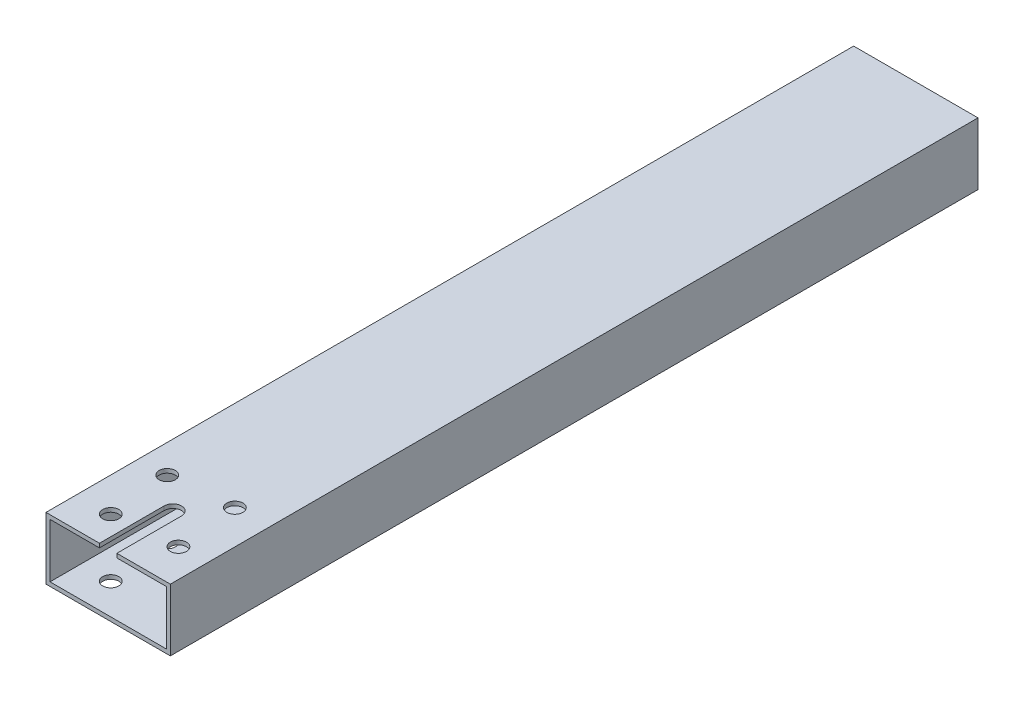
ISO-10303-21;
HEADER;
FILE_DESCRIPTION(('STEP AP214'),'2;1');
FILE_NAME('part.step','',(''),(''),'','','');
FILE_SCHEMA(('AUTOMOTIVE_DESIGN { 1 0 10303 214 1 1 1 1 }'));
ENDSEC;
DATA;
#1=APPLICATION_CONTEXT('core data for automotive mechanical design processes');
#2=APPLICATION_PROTOCOL_DEFINITION('international standard','automotive_design',2000,#1);
#3=PRODUCT_CONTEXT('',#1,'mechanical');
#4=PRODUCT('Part','Part','',(#3));
#5=PRODUCT_RELATED_PRODUCT_CATEGORY('part','',(#4));
#6=PRODUCT_DEFINITION_FORMATION('','',#4);
#7=PRODUCT_DEFINITION_CONTEXT('part definition',#1,'design');
#8=PRODUCT_DEFINITION('design','',#6,#7);
#9=PRODUCT_DEFINITION_SHAPE('','',#8);
#10=(LENGTH_UNIT() NAMED_UNIT(*) SI_UNIT(.MILLI.,.METRE.));
#11=(NAMED_UNIT(*) PLANE_ANGLE_UNIT() SI_UNIT($,.RADIAN.));
#12=(NAMED_UNIT(*) SI_UNIT($,.STERADIAN.) SOLID_ANGLE_UNIT());
#13=UNCERTAINTY_MEASURE_WITH_UNIT(LENGTH_MEASURE(1.E-05),#10,'distance_accuracy_value','');
#14=(GEOMETRIC_REPRESENTATION_CONTEXT(3) GLOBAL_UNCERTAINTY_ASSIGNED_CONTEXT((#13)) GLOBAL_UNIT_ASSIGNED_CONTEXT((#10,
#11,#12)) REPRESENTATION_CONTEXT('',''));
#15=CARTESIAN_POINT('',(0.,0.,0.));
#16=DIRECTION('',(0.,0.,1.));
#17=DIRECTION('',(1.,0.,0.));
#18=AXIS2_PLACEMENT_3D('',#15,#16,#17);
#19=CARTESIAN_POINT('',(0.,0.,330.));
#20=DIRECTION('',(0.,0.,1.));
#21=DIRECTION('',(1.,0.,0.));
#22=AXIS2_PLACEMENT_3D('',#19,#20,#21);
#23=PLANE('',#22);
#24=DIRECTION('',(0.,1.,0.));
#25=VECTOR('',#24,1.);
#26=CARTESIAN_POINT('',(7.83839252336444,8.67635514018689,330.));
#27=LINE('',#26,#25);
#28=CARTESIAN_POINT('',(7.83839252336444,15.9153551401869,330.));
#29=VERTEX_POINT('',#28);
#30=CARTESIAN_POINT('',(7.83839252336444,17.5663551401869,330.));
#31=VERTEX_POINT('',#30);
#32=EDGE_CURVE('E156',#29,#31,#27,.T.);
#33=ORIENTED_EDGE('',*,*,#32,.T.);
#34=DIRECTION('',(-1.,0.,0.));
#35=VECTOR('',#34,1.);
#36=CARTESIAN_POINT('',(-14.0056074766356,17.5663551401869,330.));
#37=LINE('',#36,#35);
#38=CARTESIAN_POINT('',(-14.0056074766356,17.5663551401869,330.));
#39=VERTEX_POINT('',#38);
#40=EDGE_CURVE('E171',#31,#39,#37,.T.);
#41=ORIENTED_EDGE('',*,*,#40,.T.);
#42=DIRECTION('',(0.,-1.,0.));
#43=VECTOR('',#42,1.);
#44=CARTESIAN_POINT('',(-14.0056074766356,17.5663551401869,330.));
#45=LINE('',#44,#43);
#46=CARTESIAN_POINT('',(-14.0056074766356,-7.83364485981309,330.));
#47=VERTEX_POINT('',#46);
#48=EDGE_CURVE('E250',#39,#47,#45,.T.);
#49=ORIENTED_EDGE('',*,*,#48,.T.);
#50=DIRECTION('',(1.,0.,0.));
#51=VECTOR('',#50,1.);
#52=CARTESIAN_POINT('',(-14.0056074766356,-7.83364485981309,330.));
#53=LINE('',#52,#51);
#54=CARTESIAN_POINT('',(36.7943925233644,-7.83364485981309,330.));
#55=VERTEX_POINT('',#54);
#56=EDGE_CURVE('E253',#47,#55,#53,.T.);
#57=ORIENTED_EDGE('',*,*,#56,.T.);
#58=DIRECTION('',(0.,1.,0.));
#59=VECTOR('',#58,1.);
#60=CARTESIAN_POINT('',(36.7943925233644,17.5663551401869,330.));
#61=LINE('',#60,#59);
#62=CARTESIAN_POINT('',(36.7943925233644,17.5663551401869,330.));
#63=VERTEX_POINT('',#62);
#64=EDGE_CURVE('E256',#55,#63,#61,.T.);
#65=ORIENTED_EDGE('',*,*,#64,.T.);
#66=CARTESIAN_POINT('',(14.9503925233644,17.5663551401869,330.));
#67=VERTEX_POINT('',#66);
#68=EDGE_CURVE('E258',#63,#67,#37,.T.);
#69=ORIENTED_EDGE('',*,*,#68,.T.);
#70=DIRECTION('',(0.,1.,0.));
#71=VECTOR('',#70,1.);
#72=CARTESIAN_POINT('',(14.9503925233644,8.67635514018689,330.));
#73=LINE('',#72,#71);
#74=CARTESIAN_POINT('',(14.9503925233644,15.9153551401869,330.));
#75=VERTEX_POINT('',#74);
#76=EDGE_CURVE('E177',#75,#67,#73,.T.);
#77=ORIENTED_EDGE('',*,*,#76,.F.);
#78=DIRECTION('',(-1.,0.,0.));
#79=VECTOR('',#78,1.);
#80=CARTESIAN_POINT('',(-12.3546074766356,15.9153551401869,330.));
#81=LINE('',#80,#79);
#82=CARTESIAN_POINT('',(35.1433925233644,15.9153551401869,330.));
#83=VERTEX_POINT('',#82);
#84=EDGE_CURVE('E228',#83,#75,#81,.T.);
#85=ORIENTED_EDGE('',*,*,#84,.F.);
#86=DIRECTION('',(0.,1.,0.));
#87=VECTOR('',#86,1.);
#88=CARTESIAN_POINT('',(35.1433925233644,15.9153551401869,330.));
#89=LINE('',#88,#87);
#90=CARTESIAN_POINT('',(35.1433925233644,-6.18264485981309,330.));
#91=VERTEX_POINT('',#90);
#92=EDGE_CURVE('E225',#91,#83,#89,.T.);
#93=ORIENTED_EDGE('',*,*,#92,.F.);
#94=DIRECTION('',(1.,0.,0.));
#95=VECTOR('',#94,1.);
#96=CARTESIAN_POINT('',(-12.3546074766356,-6.18264485981309,330.));
#97=LINE('',#96,#95);
#98=CARTESIAN_POINT('',(-12.3546074766356,-6.18264485981309,330.));
#99=VERTEX_POINT('',#98);
#100=EDGE_CURVE('E222',#99,#91,#97,.T.);
#101=ORIENTED_EDGE('',*,*,#100,.F.);
#102=DIRECTION('',(0.,-1.,0.));
#103=VECTOR('',#102,1.);
#104=CARTESIAN_POINT('',(-12.3546074766356,15.9153551401869,330.));
#105=LINE('',#104,#103);
#106=CARTESIAN_POINT('',(-12.3546074766356,15.9153551401869,330.));
#107=VERTEX_POINT('',#106);
#108=EDGE_CURVE('E220',#107,#99,#105,.T.);
#109=ORIENTED_EDGE('',*,*,#108,.F.);
#110=EDGE_CURVE('E227',#29,#107,#81,.T.);
#111=ORIENTED_EDGE('',*,*,#110,.F.);
#112=EDGE_LOOP('',(#33,#41,#49,#57,#65,#69,#77,#85,#93,#101,#109,#111));
#113=FACE_BOUND('',#112,.T.);
#114=ADVANCED_FACE('F63',(#113),#23,.T.);
#115=CARTESIAN_POINT('',(0.,0.,0.));
#116=DIRECTION('',(0.,0.,1.));
#117=DIRECTION('',(1.,0.,0.));
#118=AXIS2_PLACEMENT_3D('',#115,#116,#117);
#119=PLANE('',#118);
#120=DIRECTION('',(0.,-1.,0.));
#121=VECTOR('',#120,1.);
#122=CARTESIAN_POINT('',(-14.0056074766356,17.5663551401869,0.));
#123=LINE('',#122,#121);
#124=CARTESIAN_POINT('',(-14.0056074766356,17.5663551401869,0.));
#125=VERTEX_POINT('',#124);
#126=CARTESIAN_POINT('',(-14.0056074766356,-7.83364485981309,0.));
#127=VERTEX_POINT('',#126);
#128=EDGE_CURVE('E249',#125,#127,#123,.T.);
#129=ORIENTED_EDGE('',*,*,#128,.F.);
#130=DIRECTION('',(-1.,0.,0.));
#131=VECTOR('',#130,1.);
#132=CARTESIAN_POINT('',(-14.0056074766356,17.5663551401869,0.));
#133=LINE('',#132,#131);
#134=CARTESIAN_POINT('',(36.7943925233644,17.5663551401869,0.));
#135=VERTEX_POINT('',#134);
#136=EDGE_CURVE('E254',#135,#125,#133,.T.);
#137=ORIENTED_EDGE('',*,*,#136,.F.);
#138=DIRECTION('',(0.,1.,0.));
#139=VECTOR('',#138,1.);
#140=CARTESIAN_POINT('',(36.7943925233644,17.5663551401869,0.));
#141=LINE('',#140,#139);
#142=CARTESIAN_POINT('',(36.7943925233644,-7.83364485981309,0.));
#143=VERTEX_POINT('',#142);
#144=EDGE_CURVE('E266',#143,#135,#141,.T.);
#145=ORIENTED_EDGE('',*,*,#144,.F.);
#146=DIRECTION('',(1.,0.,0.));
#147=VECTOR('',#146,1.);
#148=CARTESIAN_POINT('',(-14.0056074766356,-7.83364485981309,0.));
#149=LINE('',#148,#147);
#150=EDGE_CURVE('E264',#127,#143,#149,.T.);
#151=ORIENTED_EDGE('',*,*,#150,.F.);
#152=EDGE_LOOP('',(#129,#137,#145,#151));
#153=FACE_BOUND('',#152,.T.);
#154=DIRECTION('',(0.,-1.,0.));
#155=VECTOR('',#154,1.);
#156=CARTESIAN_POINT('',(-12.3546074766356,15.9153551401869,0.));
#157=LINE('',#156,#155);
#158=CARTESIAN_POINT('',(-12.3546074766356,15.9153551401869,0.));
#159=VERTEX_POINT('',#158);
#160=CARTESIAN_POINT('',(-12.3546074766356,-6.18264485981309,0.));
#161=VERTEX_POINT('',#160);
#162=EDGE_CURVE('E219',#159,#161,#157,.T.);
#163=ORIENTED_EDGE('',*,*,#162,.T.);
#164=DIRECTION('',(1.,0.,0.));
#165=VECTOR('',#164,1.);
#166=CARTESIAN_POINT('',(-12.3546074766356,-6.18264485981309,0.));
#167=LINE('',#166,#165);
#168=CARTESIAN_POINT('',(35.1433925233644,-6.18264485981309,0.));
#169=VERTEX_POINT('',#168);
#170=EDGE_CURVE('E233',#161,#169,#167,.T.);
#171=ORIENTED_EDGE('',*,*,#170,.T.);
#172=DIRECTION('',(0.,1.,0.));
#173=VECTOR('',#172,1.);
#174=CARTESIAN_POINT('',(35.1433925233644,15.9153551401869,0.));
#175=LINE('',#174,#173);
#176=CARTESIAN_POINT('',(35.1433925233644,15.9153551401869,0.));
#177=VERTEX_POINT('',#176);
#178=EDGE_CURVE('E236',#169,#177,#175,.T.);
#179=ORIENTED_EDGE('',*,*,#178,.T.);
#180=DIRECTION('',(-1.,0.,0.));
#181=VECTOR('',#180,1.);
#182=CARTESIAN_POINT('',(-12.3546074766356,15.9153551401869,0.));
#183=LINE('',#182,#181);
#184=EDGE_CURVE('E223',#177,#159,#183,.T.);
#185=ORIENTED_EDGE('',*,*,#184,.T.);
#186=EDGE_LOOP('',(#163,#171,#179,#185));
#187=FACE_BOUND('',#186,.T.);
#188=ADVANCED_FACE('F306',(#153,#187),#119,.F.);
#189=CARTESIAN_POINT('',(-14.0056074766356,17.5663551401869,330.));
#190=DIRECTION('',(1.,0.,0.));
#191=DIRECTION('',(0.,1.,0.));
#192=AXIS2_PLACEMENT_3D('',#189,#190,#191);
#193=PLANE('',#192);
#194=ORIENTED_EDGE('',*,*,#128,.T.);
#195=DIRECTION('',(0.,0.,-1.));
#196=VECTOR('',#195,1.);
#197=CARTESIAN_POINT('',(-14.0056074766356,-7.83364485981309,330.));
#198=LINE('',#197,#196);
#199=EDGE_CURVE('E277',#47,#127,#198,.T.);
#200=ORIENTED_EDGE('',*,*,#199,.F.);
#201=ORIENTED_EDGE('',*,*,#48,.F.);
#202=DIRECTION('',(0.,0.,-1.));
#203=VECTOR('',#202,1.);
#204=CARTESIAN_POINT('',(-14.0056074766356,17.5663551401869,330.));
#205=LINE('',#204,#203);
#206=EDGE_CURVE('E261',#39,#125,#205,.T.);
#207=ORIENTED_EDGE('',*,*,#206,.T.);
#208=EDGE_LOOP('',(#194,#200,#201,#207));
#209=FACE_BOUND('',#208,.T.);
#210=ADVANCED_FACE('F65',(#209),#193,.F.);
#211=CARTESIAN_POINT('',(-14.0056074766356,-7.83364485981309,330.));
#212=DIRECTION('',(0.,1.,0.));
#213=DIRECTION('',(0.,0.,1.));
#214=AXIS2_PLACEMENT_3D('',#211,#212,#213);
#215=PLANE('',#214);
#216=CARTESIAN_POINT('',(-0.141249706883617,-7.83364485981309,317.401704524837));
#217=DIRECTION('',(0.,1.,0.));
#218=DIRECTION('',(0.,0.,1.));
#219=AXIS2_PLACEMENT_3D('',#216,#217,#218);
#220=CIRCLE('',#219,3.30000000399997);
#221=CARTESIAN_POINT('',(-0.141249706883617,-7.83364485981309,320.701704528837));
#222=VERTEX_POINT('',#221);
#223=EDGE_CURVE('E193',#222,#222,#220,.T.);
#224=ORIENTED_EDGE('',*,*,#223,.T.);
#225=EDGE_LOOP('',(#224));
#226=FACE_BOUND('',#225,.T.);
#227=CARTESIAN_POINT('',(25.2120970482021,-7.83364485981309,315.119642230248));
#228=DIRECTION('',(0.,1.,0.));
#229=DIRECTION('',(0.,0.,1.));
#230=AXIS2_PLACEMENT_3D('',#227,#228,#229);
#231=CIRCLE('',#230,3.30000000400001);
#232=CARTESIAN_POINT('',(25.2120970482021,-7.83364485981309,318.419642234248));
#233=VERTEX_POINT('',#232);
#234=EDGE_CURVE('E187',#233,#233,#231,.T.);
#235=ORIENTED_EDGE('',*,*,#234,.T.);
#236=EDGE_LOOP('',(#235));
#237=FACE_BOUND('',#236,.T.);
#238=CARTESIAN_POINT('',(22.9300347536127,-7.83364485981309,289.766295475162));
#239=DIRECTION('',(0.,1.,0.));
#240=DIRECTION('',(0.,0.,1.));
#241=AXIS2_PLACEMENT_3D('',#238,#239,#240);
#242=CIRCLE('',#241,3.30000000400003);
#243=CARTESIAN_POINT('',(22.9300347536127,-7.83364485981309,293.066295479162));
#244=VERTEX_POINT('',#243);
#245=EDGE_CURVE('E180',#244,#244,#242,.T.);
#246=ORIENTED_EDGE('',*,*,#245,.T.);
#247=EDGE_LOOP('',(#246));
#248=FACE_BOUND('',#247,.T.);
#249=CARTESIAN_POINT('',(-2.42331200147296,-7.83364485981309,292.048357769752));
#250=DIRECTION('',(0.,1.,0.));
#251=DIRECTION('',(0.,0.,1.));
#252=AXIS2_PLACEMENT_3D('',#249,#250,#251);
#253=CIRCLE('',#252,3.300000004);
#254=CARTESIAN_POINT('',(-2.42331200147296,-7.83364485981309,295.348357773752));
#255=VERTEX_POINT('',#254);
#256=EDGE_CURVE('E198',#255,#255,#253,.T.);
#257=ORIENTED_EDGE('',*,*,#256,.T.);
#258=EDGE_LOOP('',(#257));
#259=FACE_BOUND('',#258,.T.);
#260=ORIENTED_EDGE('',*,*,#150,.T.);
#261=DIRECTION('',(0.,0.,-1.));
#262=VECTOR('',#261,1.);
#263=CARTESIAN_POINT('',(36.7943925233644,-7.83364485981309,330.));
#264=LINE('',#263,#262);
#265=EDGE_CURVE('E274',#55,#143,#264,.T.);
#266=ORIENTED_EDGE('',*,*,#265,.F.);
#267=ORIENTED_EDGE('',*,*,#56,.F.);
#268=ORIENTED_EDGE('',*,*,#199,.T.);
#269=EDGE_LOOP('',(#260,#266,#267,#268));
#270=FACE_BOUND('',#269,.T.);
#271=ADVANCED_FACE('F330',(#226,#237,#248,#259,#270),#215,.F.);
#272=CARTESIAN_POINT('',(36.7943925233644,17.5663551401869,330.));
#273=DIRECTION('',(-1.,0.,0.));
#274=DIRECTION('',(0.,0.,1.));
#275=AXIS2_PLACEMENT_3D('',#272,#273,#274);
#276=PLANE('',#275);
#277=ORIENTED_EDGE('',*,*,#144,.T.);
#278=DIRECTION('',(0.,0.,-1.));
#279=VECTOR('',#278,1.);
#280=CARTESIAN_POINT('',(36.7943925233644,17.5663551401869,330.));
#281=LINE('',#280,#279);
#282=EDGE_CURVE('E271',#63,#135,#281,.T.);
#283=ORIENTED_EDGE('',*,*,#282,.F.);
#284=ORIENTED_EDGE('',*,*,#64,.F.);
#285=ORIENTED_EDGE('',*,*,#265,.T.);
#286=EDGE_LOOP('',(#277,#283,#284,#285));
#287=FACE_BOUND('',#286,.T.);
#288=ADVANCED_FACE('F337',(#287),#276,.F.);
#289=CARTESIAN_POINT('',(-14.0056074766356,17.5663551401869,330.));
#290=DIRECTION('',(0.,-1.,0.));
#291=DIRECTION('',(0.,0.,-1.));
#292=AXIS2_PLACEMENT_3D('',#289,#290,#291);
#293=PLANE('',#292);
#294=CARTESIAN_POINT('',(-0.141249706883617,17.5663551401869,317.401704524837));
#295=DIRECTION('',(0.,1.,0.));
#296=DIRECTION('',(0.,0.,1.));
#297=AXIS2_PLACEMENT_3D('',#294,#295,#296);
#298=CIRCLE('',#297,3.30000000399997);
#299=CARTESIAN_POINT('',(-0.141249706883617,17.5663551401869,320.701704528837));
#300=VERTEX_POINT('',#299);
#301=EDGE_CURVE('E176',#300,#300,#298,.T.);
#302=ORIENTED_EDGE('',*,*,#301,.F.);
#303=EDGE_LOOP('',(#302));
#304=FACE_BOUND('',#303,.T.);
#305=CARTESIAN_POINT('',(25.2120970482021,17.5663551401869,315.119642230248));
#306=DIRECTION('',(0.,1.,0.));
#307=DIRECTION('',(0.,0.,1.));
#308=AXIS2_PLACEMENT_3D('',#305,#306,#307);
#309=CIRCLE('',#308,3.30000000400001);
#310=CARTESIAN_POINT('',(25.2120970482021,17.5663551401869,318.419642234248));
#311=VERTEX_POINT('',#310);
#312=EDGE_CURVE('E190',#311,#311,#309,.T.);
#313=ORIENTED_EDGE('',*,*,#312,.F.);
#314=EDGE_LOOP('',(#313));
#315=FACE_BOUND('',#314,.T.);
#316=CARTESIAN_POINT('',(22.9300347536127,17.5663551401869,289.766295475162));
#317=DIRECTION('',(0.,1.,0.));
#318=DIRECTION('',(0.,0.,1.));
#319=AXIS2_PLACEMENT_3D('',#316,#317,#318);
#320=CIRCLE('',#319,3.30000000400003);
#321=CARTESIAN_POINT('',(22.9300347536127,17.5663551401869,293.066295479162));
#322=VERTEX_POINT('',#321);
#323=EDGE_CURVE('E184',#322,#322,#320,.T.);
#324=ORIENTED_EDGE('',*,*,#323,.F.);
#325=EDGE_LOOP('',(#324));
#326=FACE_BOUND('',#325,.T.);
#327=CARTESIAN_POINT('',(-2.42331200147296,17.5663551401869,292.048357769752));
#328=DIRECTION('',(0.,1.,0.));
#329=DIRECTION('',(0.,0.,1.));
#330=AXIS2_PLACEMENT_3D('',#327,#328,#329);
#331=CIRCLE('',#330,3.300000004);
#332=CARTESIAN_POINT('',(-2.42331200147296,17.5663551401869,295.348357773752));
#333=VERTEX_POINT('',#332);
#334=EDGE_CURVE('E183',#333,#333,#331,.T.);
#335=ORIENTED_EDGE('',*,*,#334,.F.);
#336=EDGE_LOOP('',(#335));
#337=FACE_BOUND('',#336,.T.);
#338=ORIENTED_EDGE('',*,*,#40,.F.);
#339=DIRECTION('',(0.,0.,1.));
#340=VECTOR('',#339,1.);
#341=CARTESIAN_POINT('',(7.83839252336443,17.5663551401869,0.));
#342=LINE('',#341,#340);
#343=CARTESIAN_POINT('',(7.83839252336444,17.5663551401869,303.584));
#344=VERTEX_POINT('',#343);
#345=EDGE_CURVE('E152',#344,#31,#342,.T.);
#346=ORIENTED_EDGE('',*,*,#345,.F.);
#347=CARTESIAN_POINT('',(11.3943925233644,17.5663551401869,303.584));
#348=DIRECTION('',(0.,1.,0.));
#349=DIRECTION('',(0.,0.,1.));
#350=AXIS2_PLACEMENT_3D('',#347,#348,#349);
#351=CIRCLE('',#350,3.556);
#352=CARTESIAN_POINT('',(14.9503925233644,17.5663551401869,303.584));
#353=VERTEX_POINT('',#352);
#354=EDGE_CURVE('E160',#353,#344,#351,.T.);
#355=ORIENTED_EDGE('',*,*,#354,.F.);
#356=DIRECTION('',(0.,0.,1.));
#357=VECTOR('',#356,1.);
#358=CARTESIAN_POINT('',(14.9503925233644,17.5663551401869,0.));
#359=LINE('',#358,#357);
#360=EDGE_CURVE('E157',#353,#67,#359,.T.);
#361=ORIENTED_EDGE('',*,*,#360,.T.);
#362=ORIENTED_EDGE('',*,*,#68,.F.);
#363=ORIENTED_EDGE('',*,*,#282,.T.);
#364=ORIENTED_EDGE('',*,*,#136,.T.);
#365=ORIENTED_EDGE('',*,*,#206,.F.);
#366=EDGE_LOOP('',(#338,#346,#355,#361,#362,#363,#364,#365));
#367=FACE_BOUND('',#366,.T.);
#368=ADVANCED_FACE('F169',(#304,#315,#326,#337,#367),#293,.F.);
#369=CARTESIAN_POINT('',(-12.3546074766356,15.9153551401869,330.));
#370=DIRECTION('',(1.,0.,0.));
#371=DIRECTION('',(0.,1.,0.));
#372=AXIS2_PLACEMENT_3D('',#369,#370,#371);
#373=PLANE('',#372);
#374=ORIENTED_EDGE('',*,*,#162,.F.);
#375=DIRECTION('',(0.,0.,-1.));
#376=VECTOR('',#375,1.);
#377=CARTESIAN_POINT('',(-12.3546074766356,15.9153551401869,330.));
#378=LINE('',#377,#376);
#379=EDGE_CURVE('E230',#107,#159,#378,.T.);
#380=ORIENTED_EDGE('',*,*,#379,.F.);
#381=ORIENTED_EDGE('',*,*,#108,.T.);
#382=DIRECTION('',(0.,0.,-1.));
#383=VECTOR('',#382,1.);
#384=CARTESIAN_POINT('',(-12.3546074766356,-6.18264485981309,330.));
#385=LINE('',#384,#383);
#386=EDGE_CURVE('E246',#99,#161,#385,.T.);
#387=ORIENTED_EDGE('',*,*,#386,.T.);
#388=EDGE_LOOP('',(#374,#380,#381,#387));
#389=FACE_BOUND('',#388,.T.);
#390=ADVANCED_FACE('F316',(#389),#373,.T.);
#391=CARTESIAN_POINT('',(-12.3546074766356,-6.18264485981309,330.));
#392=DIRECTION('',(0.,1.,0.));
#393=DIRECTION('',(0.,0.,1.));
#394=AXIS2_PLACEMENT_3D('',#391,#392,#393);
#395=PLANE('',#394);
#396=CARTESIAN_POINT('',(-0.141249706883617,-6.18264485981309,317.401704524837));
#397=DIRECTION('',(0.,1.,0.));
#398=DIRECTION('',(0.,0.,1.));
#399=AXIS2_PLACEMENT_3D('',#396,#397,#398);
#400=CIRCLE('',#399,3.30000000399997);
#401=CARTESIAN_POINT('',(-0.141249706883617,-6.18264485981309,320.701704528837));
#402=VERTEX_POINT('',#401);
#403=EDGE_CURVE('E216',#402,#402,#400,.T.);
#404=ORIENTED_EDGE('',*,*,#403,.F.);
#405=EDGE_LOOP('',(#404));
#406=FACE_BOUND('',#405,.T.);
#407=CARTESIAN_POINT('',(25.2120970482021,-6.18264485981309,315.119642230248));
#408=DIRECTION('',(0.,1.,0.));
#409=DIRECTION('',(0.,0.,1.));
#410=AXIS2_PLACEMENT_3D('',#407,#408,#409);
#411=CIRCLE('',#410,3.30000000400001);
#412=CARTESIAN_POINT('',(25.2120970482021,-6.18264485981309,318.419642234248));
#413=VERTEX_POINT('',#412);
#414=EDGE_CURVE('E212',#413,#413,#411,.T.);
#415=ORIENTED_EDGE('',*,*,#414,.F.);
#416=EDGE_LOOP('',(#415));
#417=FACE_BOUND('',#416,.T.);
#418=CARTESIAN_POINT('',(22.9300347536127,-6.18264485981309,289.766295475162));
#419=DIRECTION('',(0.,1.,0.));
#420=DIRECTION('',(0.,0.,1.));
#421=AXIS2_PLACEMENT_3D('',#418,#419,#420);
#422=CIRCLE('',#421,3.30000000400003);
#423=CARTESIAN_POINT('',(22.9300347536127,-6.18264485981309,293.066295479162));
#424=VERTEX_POINT('',#423);
#425=EDGE_CURVE('E208',#424,#424,#422,.T.);
#426=ORIENTED_EDGE('',*,*,#425,.F.);
#427=EDGE_LOOP('',(#426));
#428=FACE_BOUND('',#427,.T.);
#429=CARTESIAN_POINT('',(-2.42331200147296,-6.18264485981309,292.048357769752));
#430=DIRECTION('',(0.,1.,0.));
#431=DIRECTION('',(0.,0.,1.));
#432=AXIS2_PLACEMENT_3D('',#429,#430,#431);
#433=CIRCLE('',#432,3.300000004);
#434=CARTESIAN_POINT('',(-2.42331200147296,-6.18264485981309,295.348357773752));
#435=VERTEX_POINT('',#434);
#436=EDGE_CURVE('E204',#435,#435,#433,.T.);
#437=ORIENTED_EDGE('',*,*,#436,.F.);
#438=EDGE_LOOP('',(#437));
#439=FACE_BOUND('',#438,.T.);
#440=ORIENTED_EDGE('',*,*,#170,.F.);
#441=ORIENTED_EDGE('',*,*,#386,.F.);
#442=ORIENTED_EDGE('',*,*,#100,.T.);
#443=DIRECTION('',(0.,0.,-1.));
#444=VECTOR('',#443,1.);
#445=CARTESIAN_POINT('',(35.1433925233644,-6.18264485981309,330.));
#446=LINE('',#445,#444);
#447=EDGE_CURVE('E244',#91,#169,#446,.T.);
#448=ORIENTED_EDGE('',*,*,#447,.T.);
#449=EDGE_LOOP('',(#440,#441,#442,#448));
#450=FACE_BOUND('',#449,.T.);
#451=ADVANCED_FACE('F321',(#406,#417,#428,#439,#450),#395,.T.);
#452=CARTESIAN_POINT('',(35.1433925233644,15.9153551401869,330.));
#453=DIRECTION('',(-1.,0.,0.));
#454=DIRECTION('',(0.,0.,1.));
#455=AXIS2_PLACEMENT_3D('',#452,#453,#454);
#456=PLANE('',#455);
#457=ORIENTED_EDGE('',*,*,#178,.F.);
#458=ORIENTED_EDGE('',*,*,#447,.F.);
#459=ORIENTED_EDGE('',*,*,#92,.T.);
#460=DIRECTION('',(0.,0.,-1.));
#461=VECTOR('',#460,1.);
#462=CARTESIAN_POINT('',(35.1433925233644,15.9153551401869,330.));
#463=LINE('',#462,#461);
#464=EDGE_CURVE('E85',#83,#177,#463,.T.);
#465=ORIENTED_EDGE('',*,*,#464,.T.);
#466=EDGE_LOOP('',(#457,#458,#459,#465));
#467=FACE_BOUND('',#466,.T.);
#468=ADVANCED_FACE('F324',(#467),#456,.T.);
#469=CARTESIAN_POINT('',(-12.3546074766356,15.9153551401869,330.));
#470=DIRECTION('',(0.,-1.,0.));
#471=DIRECTION('',(0.,0.,-1.));
#472=AXIS2_PLACEMENT_3D('',#469,#470,#471);
#473=PLANE('',#472);
#474=DIRECTION('',(0.,0.,-1.));
#475=VECTOR('',#474,1.);
#476=CARTESIAN_POINT('',(7.83839252336445,15.9153551401869,330.));
#477=LINE('',#476,#475);
#478=CARTESIAN_POINT('',(7.83839252336444,15.9153551401869,303.584));
#479=VERTEX_POINT('',#478);
#480=EDGE_CURVE('E12',#29,#479,#477,.T.);
#481=ORIENTED_EDGE('',*,*,#480,.F.);
#482=ORIENTED_EDGE('',*,*,#110,.T.);
#483=ORIENTED_EDGE('',*,*,#379,.T.);
#484=ORIENTED_EDGE('',*,*,#184,.F.);
#485=ORIENTED_EDGE('',*,*,#464,.F.);
#486=ORIENTED_EDGE('',*,*,#84,.T.);
#487=DIRECTION('',(0.,0.,-1.));
#488=VECTOR('',#487,1.);
#489=CARTESIAN_POINT('',(14.9503925233644,15.9153551401869,330.));
#490=LINE('',#489,#488);
#491=CARTESIAN_POINT('',(14.9503925233644,15.9153551401869,303.584));
#492=VERTEX_POINT('',#491);
#493=EDGE_CURVE('E71',#75,#492,#490,.T.);
#494=ORIENTED_EDGE('',*,*,#493,.T.);
#495=CARTESIAN_POINT('',(11.3943925233644,15.9153551401869,303.584));
#496=DIRECTION('',(0.,-1.,0.));
#497=DIRECTION('',(0.,0.,-1.));
#498=AXIS2_PLACEMENT_3D('',#495,#496,#497);
#499=CIRCLE('',#498,3.556);
#500=EDGE_CURVE('E280',#479,#492,#499,.T.);
#501=ORIENTED_EDGE('',*,*,#500,.F.);
#502=EDGE_LOOP('',(#481,#482,#483,#484,#485,#486,#494,#501));
#503=FACE_BOUND('',#502,.T.);
#504=CARTESIAN_POINT('',(-0.141249706883617,15.9153551401869,317.401704524837));
#505=DIRECTION('',(0.,-1.,0.));
#506=DIRECTION('',(0.,0.,-1.));
#507=AXIS2_PLACEMENT_3D('',#504,#505,#506);
#508=CIRCLE('',#507,3.30000000399997);
#509=CARTESIAN_POINT('',(-0.141249706883617,15.9153551401869,314.101704520837));
#510=VERTEX_POINT('',#509);
#511=EDGE_CURVE('E215',#510,#510,#508,.T.);
#512=ORIENTED_EDGE('',*,*,#511,.F.);
#513=EDGE_LOOP('',(#512));
#514=FACE_BOUND('',#513,.T.);
#515=CARTESIAN_POINT('',(25.2120970482021,15.9153551401869,315.119642230248));
#516=DIRECTION('',(0.,-1.,0.));
#517=DIRECTION('',(0.,0.,-1.));
#518=AXIS2_PLACEMENT_3D('',#515,#516,#517);
#519=CIRCLE('',#518,3.30000000400001);
#520=CARTESIAN_POINT('',(25.2120970482021,15.9153551401869,311.819642226248));
#521=VERTEX_POINT('',#520);
#522=EDGE_CURVE('E211',#521,#521,#519,.T.);
#523=ORIENTED_EDGE('',*,*,#522,.F.);
#524=EDGE_LOOP('',(#523));
#525=FACE_BOUND('',#524,.T.);
#526=CARTESIAN_POINT('',(22.9300347536127,15.9153551401869,289.766295475162));
#527=DIRECTION('',(0.,-1.,0.));
#528=DIRECTION('',(0.,0.,-1.));
#529=AXIS2_PLACEMENT_3D('',#526,#527,#528);
#530=CIRCLE('',#529,3.30000000400003);
#531=CARTESIAN_POINT('',(22.9300347536127,15.9153551401869,286.466295471162));
#532=VERTEX_POINT('',#531);
#533=EDGE_CURVE('E207',#532,#532,#530,.T.);
#534=ORIENTED_EDGE('',*,*,#533,.F.);
#535=EDGE_LOOP('',(#534));
#536=FACE_BOUND('',#535,.T.);
#537=CARTESIAN_POINT('',(-2.42331200147296,15.9153551401869,292.048357769752));
#538=DIRECTION('',(0.,-1.,0.));
#539=DIRECTION('',(0.,0.,-1.));
#540=AXIS2_PLACEMENT_3D('',#537,#538,#539);
#541=CIRCLE('',#540,3.300000004);
#542=CARTESIAN_POINT('',(-2.42331200147296,15.9153551401869,288.748357765752));
#543=VERTEX_POINT('',#542);
#544=EDGE_CURVE('E201',#543,#543,#541,.T.);
#545=ORIENTED_EDGE('',*,*,#544,.F.);
#546=EDGE_LOOP('',(#545));
#547=FACE_BOUND('',#546,.T.);
#548=ADVANCED_FACE('F290',(#503,#514,#525,#536,#547),#473,.T.);
#549=CARTESIAN_POINT('',(-2.42331200147296,-7.83364485981309,292.048357769752));
#550=DIRECTION('',(0.,1.,0.));
#551=DIRECTION('',(0.,0.,1.));
#552=AXIS2_PLACEMENT_3D('',#549,#550,#551);
#553=CYLINDRICAL_SURFACE('',#552,3.300000004);
#554=ORIENTED_EDGE('',*,*,#544,.T.);
#555=EDGE_LOOP('',(#554));
#556=FACE_BOUND('',#555,.T.);
#557=ORIENTED_EDGE('',*,*,#334,.T.);
#558=EDGE_LOOP('',(#557));
#559=FACE_BOUND('',#558,.T.);
#560=ADVANCED_FACE('F361',(#556,#559),#553,.F.);
#561=CARTESIAN_POINT('',(22.9300347536127,-7.83364485981309,289.766295475162));
#562=DIRECTION('',(0.,1.,0.));
#563=DIRECTION('',(0.,0.,1.));
#564=AXIS2_PLACEMENT_3D('',#561,#562,#563);
#565=CYLINDRICAL_SURFACE('',#564,3.30000000400003);
#566=ORIENTED_EDGE('',*,*,#533,.T.);
#567=EDGE_LOOP('',(#566));
#568=FACE_BOUND('',#567,.T.);
#569=ORIENTED_EDGE('',*,*,#323,.T.);
#570=EDGE_LOOP('',(#569));
#571=FACE_BOUND('',#570,.T.);
#572=ADVANCED_FACE('F369',(#568,#571),#565,.F.);
#573=CARTESIAN_POINT('',(25.2120970482021,-7.83364485981309,315.119642230248));
#574=DIRECTION('',(0.,1.,0.));
#575=DIRECTION('',(0.,0.,1.));
#576=AXIS2_PLACEMENT_3D('',#573,#574,#575);
#577=CYLINDRICAL_SURFACE('',#576,3.30000000400001);
#578=ORIENTED_EDGE('',*,*,#522,.T.);
#579=EDGE_LOOP('',(#578));
#580=FACE_BOUND('',#579,.T.);
#581=ORIENTED_EDGE('',*,*,#312,.T.);
#582=EDGE_LOOP('',(#581));
#583=FACE_BOUND('',#582,.T.);
#584=ADVANCED_FACE('F370',(#580,#583),#577,.F.);
#585=CARTESIAN_POINT('',(-0.141249706883617,-7.83364485981309,317.401704524837));
#586=DIRECTION('',(0.,1.,0.));
#587=DIRECTION('',(0.,0.,1.));
#588=AXIS2_PLACEMENT_3D('',#585,#586,#587);
#589=CYLINDRICAL_SURFACE('',#588,3.30000000399997);
#590=ORIENTED_EDGE('',*,*,#511,.T.);
#591=EDGE_LOOP('',(#590));
#592=FACE_BOUND('',#591,.T.);
#593=ORIENTED_EDGE('',*,*,#301,.T.);
#594=EDGE_LOOP('',(#593));
#595=FACE_BOUND('',#594,.T.);
#596=ADVANCED_FACE('F358',(#592,#595),#589,.F.);
#597=ORIENTED_EDGE('',*,*,#436,.T.);
#598=EDGE_LOOP('',(#597));
#599=FACE_BOUND('',#598,.T.);
#600=ORIENTED_EDGE('',*,*,#256,.F.);
#601=EDGE_LOOP('',(#600));
#602=FACE_BOUND('',#601,.T.);
#603=ADVANCED_FACE('F355',(#599,#602),#553,.F.);
#604=ORIENTED_EDGE('',*,*,#425,.T.);
#605=EDGE_LOOP('',(#604));
#606=FACE_BOUND('',#605,.T.);
#607=ORIENTED_EDGE('',*,*,#245,.F.);
#608=EDGE_LOOP('',(#607));
#609=FACE_BOUND('',#608,.T.);
#610=ADVANCED_FACE('F357',(#606,#609),#565,.F.);
#611=ORIENTED_EDGE('',*,*,#414,.T.);
#612=EDGE_LOOP('',(#611));
#613=FACE_BOUND('',#612,.T.);
#614=ORIENTED_EDGE('',*,*,#234,.F.);
#615=EDGE_LOOP('',(#614));
#616=FACE_BOUND('',#615,.T.);
#617=ADVANCED_FACE('F366',(#613,#616),#577,.F.);
#618=ORIENTED_EDGE('',*,*,#403,.T.);
#619=EDGE_LOOP('',(#618));
#620=FACE_BOUND('',#619,.T.);
#621=ORIENTED_EDGE('',*,*,#223,.F.);
#622=EDGE_LOOP('',(#621));
#623=FACE_BOUND('',#622,.T.);
#624=ADVANCED_FACE('F373',(#620,#623),#589,.F.);
#625=CARTESIAN_POINT('',(7.83839252336443,8.67635514018689,0.));
#626=DIRECTION('',(-1.,0.,0.));
#627=DIRECTION('',(0.,0.,1.));
#628=AXIS2_PLACEMENT_3D('',#625,#626,#627);
#629=PLANE('',#628);
#630=ORIENTED_EDGE('',*,*,#480,.T.);
#631=DIRECTION('',(0.,1.,0.));
#632=VECTOR('',#631,1.);
#633=CARTESIAN_POINT('',(7.83839252336444,8.67635514018689,303.584));
#634=LINE('',#633,#632);
#635=EDGE_CURVE('E78',#479,#344,#634,.T.);
#636=ORIENTED_EDGE('',*,*,#635,.T.);
#637=ORIENTED_EDGE('',*,*,#345,.T.);
#638=ORIENTED_EDGE('',*,*,#32,.F.);
#639=EDGE_LOOP('',(#630,#636,#637,#638));
#640=FACE_BOUND('',#639,.T.);
#641=ADVANCED_FACE('F150',(#640),#629,.F.);
#642=CARTESIAN_POINT('',(14.9503925233644,8.67635514018689,0.));
#643=DIRECTION('',(-1.,0.,0.));
#644=DIRECTION('',(0.,0.,1.));
#645=AXIS2_PLACEMENT_3D('',#642,#643,#644);
#646=PLANE('',#645);
#647=ORIENTED_EDGE('',*,*,#76,.T.);
#648=ORIENTED_EDGE('',*,*,#360,.F.);
#649=DIRECTION('',(0.,1.,0.));
#650=VECTOR('',#649,1.);
#651=CARTESIAN_POINT('',(14.9503925233644,8.67635514018689,303.584));
#652=LINE('',#651,#650);
#653=EDGE_CURVE('E163',#492,#353,#652,.T.);
#654=ORIENTED_EDGE('',*,*,#653,.F.);
#655=ORIENTED_EDGE('',*,*,#493,.F.);
#656=EDGE_LOOP('',(#647,#648,#654,#655));
#657=FACE_BOUND('',#656,.T.);
#658=ADVANCED_FACE('F295',(#657),#646,.T.);
#659=CARTESIAN_POINT('',(11.3943925233644,8.67635514018689,303.584));
#660=DIRECTION('',(0.,1.,0.));
#661=DIRECTION('',(0.,0.,1.));
#662=AXIS2_PLACEMENT_3D('',#659,#660,#661);
#663=CYLINDRICAL_SURFACE('',#662,3.556);
#664=ORIENTED_EDGE('',*,*,#500,.T.);
#665=ORIENTED_EDGE('',*,*,#653,.T.);
#666=ORIENTED_EDGE('',*,*,#354,.T.);
#667=ORIENTED_EDGE('',*,*,#635,.F.);
#668=EDGE_LOOP('',(#664,#665,#666,#667));
#669=FACE_BOUND('',#668,.T.);
#670=ADVANCED_FACE('F161',(#669),#663,.F.);
#671=CLOSED_SHELL('',(#114,#188,#210,#271,#288,#368,#390,#451,#468,#548,#560,#572,#584,#596,
#603,#610,#617,#624,#641,#658,#670));
#672=MANIFOLD_SOLID_BREP('B2',#671);
#673=ADVANCED_BREP_SHAPE_REPRESENTATION('',(#18,#672),#14);
#674=SHAPE_DEFINITION_REPRESENTATION(#9,#673);
ENDSEC;
END-ISO-10303-21;
